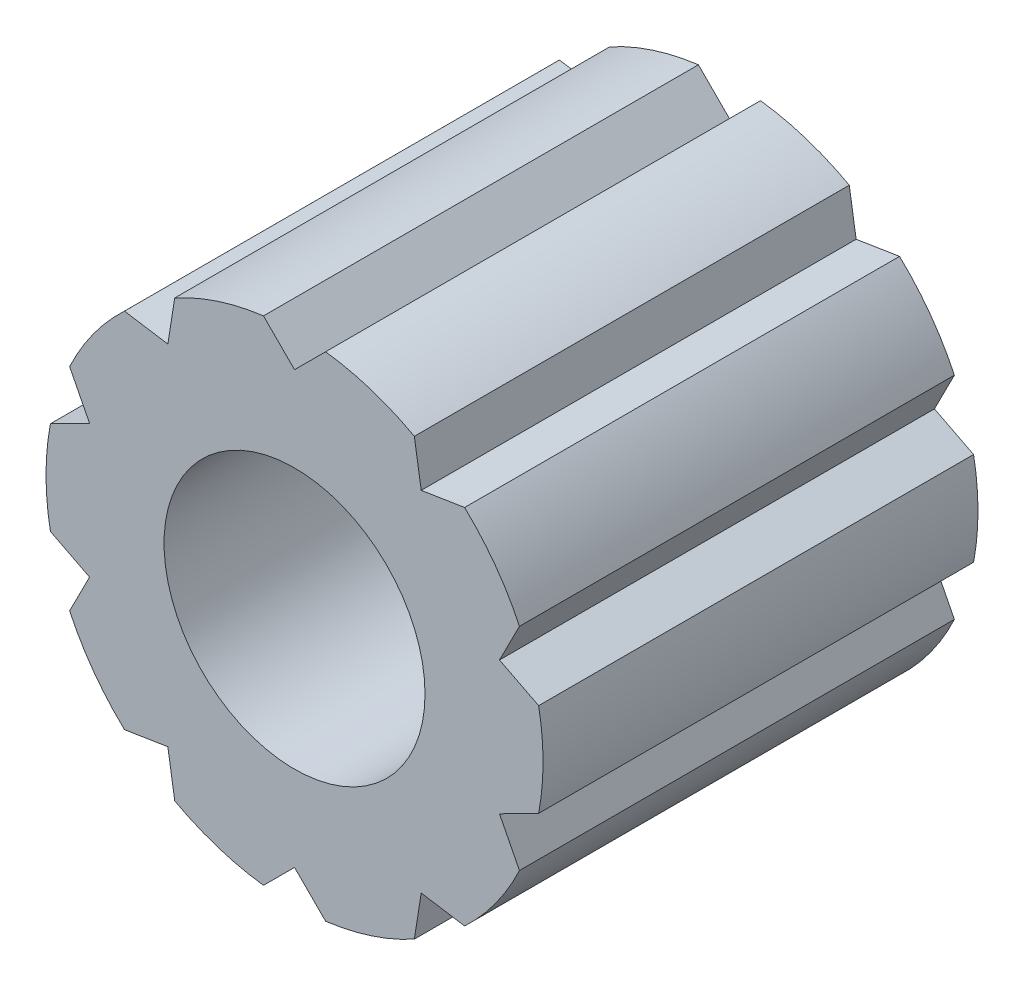
ISO-10303-21;
HEADER;
FILE_DESCRIPTION(('STEP AP214'),'2;1');
FILE_NAME('part.step','',(''),(''),'','','');
FILE_SCHEMA(('AUTOMOTIVE_DESIGN { 1 0 10303 214 1 1 1 1 }'));
ENDSEC;
DATA;
#1=APPLICATION_CONTEXT('core data for automotive mechanical design processes');
#2=APPLICATION_PROTOCOL_DEFINITION('international standard','automotive_design',2000,#1);
#3=PRODUCT_CONTEXT('',#1,'mechanical');
#4=PRODUCT('Part','Part','',(#3));
#5=PRODUCT_RELATED_PRODUCT_CATEGORY('part','',(#4));
#6=PRODUCT_DEFINITION_FORMATION('','',#4);
#7=PRODUCT_DEFINITION_CONTEXT('part definition',#1,'design');
#8=PRODUCT_DEFINITION('design','',#6,#7);
#9=PRODUCT_DEFINITION_SHAPE('','',#8);
#10=(LENGTH_UNIT() NAMED_UNIT(*) SI_UNIT(.MILLI.,.METRE.));
#11=(NAMED_UNIT(*) PLANE_ANGLE_UNIT() SI_UNIT($,.RADIAN.));
#12=(NAMED_UNIT(*) SI_UNIT($,.STERADIAN.) SOLID_ANGLE_UNIT());
#13=UNCERTAINTY_MEASURE_WITH_UNIT(LENGTH_MEASURE(1.E-05),#10,'distance_accuracy_value','');
#14=(GEOMETRIC_REPRESENTATION_CONTEXT(3) GLOBAL_UNCERTAINTY_ASSIGNED_CONTEXT((#13)) GLOBAL_UNIT_ASSIGNED_CONTEXT((#10,
#11,#12)) REPRESENTATION_CONTEXT('',''));
#15=CARTESIAN_POINT('',(0.,0.,0.));
#16=DIRECTION('',(0.,0.,1.));
#17=DIRECTION('',(1.,0.,0.));
#18=AXIS2_PLACEMENT_3D('',#15,#16,#17);
#19=CARTESIAN_POINT('',(0.,0.,7.));
#20=DIRECTION('',(0.,0.,1.));
#21=DIRECTION('',(1.,0.,0.));
#22=AXIS2_PLACEMENT_3D('',#19,#20,#21);
#23=PLANE('',#22);
#24=CARTESIAN_POINT('',(0.,0.,7.));
#25=DIRECTION('',(0.,0.,1.));
#26=DIRECTION('',(1.,0.,0.));
#27=AXIS2_PLACEMENT_3D('',#24,#25,#26);
#28=CIRCLE('',#27,4.);
#29=CARTESIAN_POINT('',(-0.5,3.96862696659689,7.));
#30=VERTEX_POINT('',#29);
#31=CARTESIAN_POINT('',(-1.92819190562839,3.50457928645781,7.));
#32=VERTEX_POINT('',#31);
#33=EDGE_CURVE('E329',#30,#32,#28,.T.);
#34=ORIENTED_EDGE('',*,*,#33,.T.);
#35=DIRECTION('',(-0.156434465040231,-0.987688340595138,0.));
#36=VECTOR('',#35,1.);
#37=CARTESIAN_POINT('',(-1.92819190562839,3.50457928645781,7.));
#38=LINE('',#37,#36);
#39=CARTESIAN_POINT('',(-2.03880777666963,2.8061781631241,7.));
#40=VERTEX_POINT('',#39);
#41=EDGE_CURVE('E167',#32,#40,#38,.T.);
#42=ORIENTED_EDGE('',*,*,#41,.T.);
#43=DIRECTION('',(-0.987688340595138,0.15643446504023,0.));
#44=VECTOR('',#43,1.);
#45=CARTESIAN_POINT('',(-2.03880777666963,2.8061781631241,7.));
#46=LINE('',#45,#44);
#47=CARTESIAN_POINT('',(-2.73720890000334,2.91679403416534,7.));
#48=VERTEX_POINT('',#47);
#49=EDGE_CURVE('E410',#40,#48,#46,.T.);
#50=ORIENTED_EDGE('',*,*,#49,.T.);
#51=CARTESIAN_POINT('',(0.,0.,7.));
#52=DIRECTION('',(0.,0.,1.));
#53=DIRECTION('',(1.,0.,0.));
#54=AXIS2_PLACEMENT_3D('',#51,#52,#53);
#55=CIRCLE('',#54,4.);
#56=CARTESIAN_POINT('',(-3.61988004013916,1.70190143516071,7.));
#57=VERTEX_POINT('',#56);
#58=EDGE_CURVE('E429',#48,#57,#55,.T.);
#59=ORIENTED_EDGE('',*,*,#58,.T.);
#60=DIRECTION('',(0.453990499739546,-0.891006524188368,0.));
#61=VECTOR('',#60,1.);
#62=CARTESIAN_POINT('',(-3.61988004013916,1.70190143516071,7.));
#63=LINE('',#62,#61);
#64=CARTESIAN_POINT('',(-3.29886027917906,1.07186467982566,7.));
#65=VERTEX_POINT('',#64);
#66=EDGE_CURVE('E426',#57,#65,#63,.T.);
#67=ORIENTED_EDGE('',*,*,#66,.T.);
#68=DIRECTION('',(-0.891006524188367,-0.453990499739548,0.));
#69=VECTOR('',#68,1.);
#70=CARTESIAN_POINT('',(-3.29886027917906,1.07186467982566,7.));
#71=LINE('',#70,#69);
#72=CARTESIAN_POINT('',(-3.92889703451411,0.750844918865556,7.));
#73=VERTEX_POINT('',#72);
#74=EDGE_CURVE('E428',#65,#73,#71,.T.);
#75=ORIENTED_EDGE('',*,*,#74,.T.);
#76=CARTESIAN_POINT('',(0.,0.,7.));
#77=DIRECTION('',(0.,0.,1.));
#78=DIRECTION('',(1.,0.,0.));
#79=AXIS2_PLACEMENT_3D('',#76,#77,#78);
#80=CIRCLE('',#79,4.);
#81=CARTESIAN_POINT('',(-3.92889703451411,-0.750844918865558,7.));
#82=VERTEX_POINT('',#81);
#83=EDGE_CURVE('E431',#73,#82,#80,.T.);
#84=ORIENTED_EDGE('',*,*,#83,.T.);
#85=DIRECTION('',(0.891006524188368,-0.453990499739547,0.));
#86=VECTOR('',#85,1.);
#87=CARTESIAN_POINT('',(-3.92889703451411,-0.750844918865558,7.));
#88=LINE('',#87,#86);
#89=CARTESIAN_POINT('',(-3.29886027917906,-1.07186467982566,7.));
#90=VERTEX_POINT('',#89);
#91=EDGE_CURVE('E437',#82,#90,#88,.T.);
#92=ORIENTED_EDGE('',*,*,#91,.T.);
#93=DIRECTION('',(-0.453990499739546,-0.891006524188368,0.));
#94=VECTOR('',#93,1.);
#95=CARTESIAN_POINT('',(-3.29886027917906,-1.07186467982566,7.));
#96=LINE('',#95,#94);
#97=CARTESIAN_POINT('',(-3.61988004013916,-1.70190143516071,7.));
#98=VERTEX_POINT('',#97);
#99=EDGE_CURVE('E439',#90,#98,#96,.T.);
#100=ORIENTED_EDGE('',*,*,#99,.T.);
#101=CARTESIAN_POINT('',(0.,0.,7.));
#102=DIRECTION('',(0.,0.,1.));
#103=DIRECTION('',(1.,0.,0.));
#104=AXIS2_PLACEMENT_3D('',#101,#102,#103);
#105=CIRCLE('',#104,4.);
#106=CARTESIAN_POINT('',(-2.73720890000334,-2.91679403416534,7.));
#107=VERTEX_POINT('',#106);
#108=EDGE_CURVE('E441',#98,#107,#105,.T.);
#109=ORIENTED_EDGE('',*,*,#108,.T.);
#110=DIRECTION('',(0.987688340595138,0.156434465040231,0.));
#111=VECTOR('',#110,1.);
#112=CARTESIAN_POINT('',(-2.73720890000334,-2.91679403416534,7.));
#113=LINE('',#112,#111);
#114=CARTESIAN_POINT('',(-2.03880777666963,-2.8061781631241,7.));
#115=VERTEX_POINT('',#114);
#116=EDGE_CURVE('E443',#107,#115,#113,.T.);
#117=ORIENTED_EDGE('',*,*,#116,.T.);
#118=DIRECTION('',(0.156434465040232,-0.987688340595138,0.));
#119=VECTOR('',#118,1.);
#120=CARTESIAN_POINT('',(-2.03880777666963,-2.8061781631241,7.));
#121=LINE('',#120,#119);
#122=CARTESIAN_POINT('',(-1.92819190562839,-3.50457928645781,7.));
#123=VERTEX_POINT('',#122);
#124=EDGE_CURVE('E445',#115,#123,#121,.T.);
#125=ORIENTED_EDGE('',*,*,#124,.T.);
#126=CARTESIAN_POINT('',(0.,0.,7.));
#127=DIRECTION('',(0.,0.,1.));
#128=DIRECTION('',(1.,0.,0.));
#129=AXIS2_PLACEMENT_3D('',#126,#127,#128);
#130=CIRCLE('',#129,4.);
#131=CARTESIAN_POINT('',(-0.5,-3.96862696659689,7.));
#132=VERTEX_POINT('',#131);
#133=EDGE_CURVE('E447',#123,#132,#130,.T.);
#134=ORIENTED_EDGE('',*,*,#133,.T.);
#135=DIRECTION('',(0.707106781186548,0.707106781186547,0.));
#136=VECTOR('',#135,1.);
#137=CARTESIAN_POINT('',(-0.5,-3.96862696659689,7.));
#138=LINE('',#137,#136);
#139=CARTESIAN_POINT('',(0.,-3.46862696659689,7.));
#140=VERTEX_POINT('',#139);
#141=EDGE_CURVE('E449',#132,#140,#138,.T.);
#142=ORIENTED_EDGE('',*,*,#141,.T.);
#143=DIRECTION('',(0.707106781186548,-0.707106781186547,0.));
#144=VECTOR('',#143,1.);
#145=CARTESIAN_POINT('',(0.,-3.46862696659689,7.));
#146=LINE('',#145,#144);
#147=CARTESIAN_POINT('',(0.499999999999999,-3.96862696659689,7.));
#148=VERTEX_POINT('',#147);
#149=EDGE_CURVE('E451',#140,#148,#146,.T.);
#150=ORIENTED_EDGE('',*,*,#149,.T.);
#151=CARTESIAN_POINT('',(0.,0.,7.));
#152=DIRECTION('',(0.,0.,1.));
#153=DIRECTION('',(1.,0.,0.));
#154=AXIS2_PLACEMENT_3D('',#151,#152,#153);
#155=CIRCLE('',#154,4.);
#156=CARTESIAN_POINT('',(1.92819190562839,-3.50457928645781,7.));
#157=VERTEX_POINT('',#156);
#158=EDGE_CURVE('E453',#148,#157,#155,.T.);
#159=ORIENTED_EDGE('',*,*,#158,.T.);
#160=DIRECTION('',(0.156434465040231,0.987688340595138,0.));
#161=VECTOR('',#160,1.);
#162=CARTESIAN_POINT('',(1.92819190562839,-3.50457928645781,7.));
#163=LINE('',#162,#161);
#164=CARTESIAN_POINT('',(2.03880777666963,-2.8061781631241,7.));
#165=VERTEX_POINT('',#164);
#166=EDGE_CURVE('E455',#157,#165,#163,.T.);
#167=ORIENTED_EDGE('',*,*,#166,.T.);
#168=DIRECTION('',(0.987688340595138,-0.15643446504023,0.));
#169=VECTOR('',#168,1.);
#170=CARTESIAN_POINT('',(2.03880777666963,-2.8061781631241,7.));
#171=LINE('',#170,#169);
#172=CARTESIAN_POINT('',(2.73720890000334,-2.91679403416534,7.));
#173=VERTEX_POINT('',#172);
#174=EDGE_CURVE('E457',#165,#173,#171,.T.);
#175=ORIENTED_EDGE('',*,*,#174,.T.);
#176=CARTESIAN_POINT('',(0.,0.,7.));
#177=DIRECTION('',(0.,0.,1.));
#178=DIRECTION('',(1.,0.,0.));
#179=AXIS2_PLACEMENT_3D('',#176,#177,#178);
#180=CIRCLE('',#179,4.);
#181=CARTESIAN_POINT('',(3.61988004013916,-1.70190143516071,7.));
#182=VERTEX_POINT('',#181);
#183=EDGE_CURVE('E459',#173,#182,#180,.T.);
#184=ORIENTED_EDGE('',*,*,#183,.T.);
#185=DIRECTION('',(-0.453990499739546,0.891006524188368,0.));
#186=VECTOR('',#185,1.);
#187=CARTESIAN_POINT('',(3.61988004013916,-1.70190143516071,7.));
#188=LINE('',#187,#186);
#189=CARTESIAN_POINT('',(3.29886027917906,-1.07186467982566,7.));
#190=VERTEX_POINT('',#189);
#191=EDGE_CURVE('E461',#182,#190,#188,.T.);
#192=ORIENTED_EDGE('',*,*,#191,.T.);
#193=DIRECTION('',(0.891006524188367,0.453990499739548,0.));
#194=VECTOR('',#193,1.);
#195=CARTESIAN_POINT('',(3.29886027917906,-1.07186467982566,7.));
#196=LINE('',#195,#194);
#197=CARTESIAN_POINT('',(3.92889703451411,-0.750844918865558,7.));
#198=VERTEX_POINT('',#197);
#199=EDGE_CURVE('E463',#190,#198,#196,.T.);
#200=ORIENTED_EDGE('',*,*,#199,.T.);
#201=CARTESIAN_POINT('',(0.,0.,7.));
#202=DIRECTION('',(0.,0.,1.));
#203=DIRECTION('',(1.,0.,0.));
#204=AXIS2_PLACEMENT_3D('',#201,#202,#203);
#205=CIRCLE('',#204,4.);
#206=CARTESIAN_POINT('',(3.92889703451411,0.750844918865558,7.));
#207=VERTEX_POINT('',#206);
#208=EDGE_CURVE('E465',#198,#207,#205,.T.);
#209=ORIENTED_EDGE('',*,*,#208,.T.);
#210=DIRECTION('',(-0.891006524188367,0.453990499739548,0.));
#211=VECTOR('',#210,1.);
#212=CARTESIAN_POINT('',(3.92889703451411,0.750844918865558,7.));
#213=LINE('',#212,#211);
#214=CARTESIAN_POINT('',(3.29886027917906,1.07186467982566,7.));
#215=VERTEX_POINT('',#214);
#216=EDGE_CURVE('E467',#207,#215,#213,.T.);
#217=ORIENTED_EDGE('',*,*,#216,.T.);
#218=DIRECTION('',(0.453990499739546,0.891006524188368,0.));
#219=VECTOR('',#218,1.);
#220=CARTESIAN_POINT('',(3.29886027917906,1.07186467982566,7.));
#221=LINE('',#220,#219);
#222=CARTESIAN_POINT('',(3.61988004013916,1.70190143516071,7.));
#223=VERTEX_POINT('',#222);
#224=EDGE_CURVE('E469',#215,#223,#221,.T.);
#225=ORIENTED_EDGE('',*,*,#224,.T.);
#226=CARTESIAN_POINT('',(0.,0.,7.));
#227=DIRECTION('',(0.,0.,1.));
#228=DIRECTION('',(1.,0.,0.));
#229=AXIS2_PLACEMENT_3D('',#226,#227,#228);
#230=CIRCLE('',#229,4.);
#231=CARTESIAN_POINT('',(2.73720890000334,2.91679403416534,7.));
#232=VERTEX_POINT('',#231);
#233=EDGE_CURVE('E471',#223,#232,#230,.T.);
#234=ORIENTED_EDGE('',*,*,#233,.T.);
#235=DIRECTION('',(-0.987688340595138,-0.156434465040231,0.));
#236=VECTOR('',#235,1.);
#237=CARTESIAN_POINT('',(2.73720890000334,2.91679403416534,7.));
#238=LINE('',#237,#236);
#239=CARTESIAN_POINT('',(2.03880777666963,2.8061781631241,7.));
#240=VERTEX_POINT('',#239);
#241=EDGE_CURVE('E473',#232,#240,#238,.T.);
#242=ORIENTED_EDGE('',*,*,#241,.T.);
#243=DIRECTION('',(-0.156434465040231,0.987688340595138,0.));
#244=VECTOR('',#243,1.);
#245=CARTESIAN_POINT('',(2.03880777666963,2.8061781631241,7.));
#246=LINE('',#245,#244);
#247=CARTESIAN_POINT('',(1.92819190562839,3.50457928645781,7.));
#248=VERTEX_POINT('',#247);
#249=EDGE_CURVE('E252',#240,#248,#246,.T.);
#250=ORIENTED_EDGE('',*,*,#249,.T.);
#251=CARTESIAN_POINT('',(0.,0.,7.));
#252=DIRECTION('',(0.,0.,1.));
#253=DIRECTION('',(1.,0.,0.));
#254=AXIS2_PLACEMENT_3D('',#251,#252,#253);
#255=CIRCLE('',#254,4.);
#256=CARTESIAN_POINT('',(0.5,3.96862696659689,7.));
#257=VERTEX_POINT('',#256);
#258=EDGE_CURVE('E246',#248,#257,#255,.T.);
#259=ORIENTED_EDGE('',*,*,#258,.T.);
#260=DIRECTION('',(-0.707106781186548,-0.707106781186547,0.));
#261=VECTOR('',#260,1.);
#262=CARTESIAN_POINT('',(0.5,3.96862696659689,7.));
#263=LINE('',#262,#261);
#264=CARTESIAN_POINT('',(0.,3.46862696659689,7.));
#265=VERTEX_POINT('',#264);
#266=EDGE_CURVE('E250',#257,#265,#263,.T.);
#267=ORIENTED_EDGE('',*,*,#266,.T.);
#268=DIRECTION('',(-0.707106781186548,0.707106781186547,0.));
#269=VECTOR('',#268,1.);
#270=CARTESIAN_POINT('',(0.,3.46862696659689,7.));
#271=LINE('',#270,#269);
#272=EDGE_CURVE('E58',#265,#30,#271,.T.);
#273=ORIENTED_EDGE('',*,*,#272,.T.);
#274=EDGE_LOOP('',(#34,#42,#50,#59,#67,#75,#84,#92,#100,#109,#117,#125,#134,#142,#150,#159,#167,
#175,#184,#192,#200,#209,#217,#225,#234,#242,#250,#259,#267,#273));
#275=FACE_BOUND('',#274,.T.);
#276=CARTESIAN_POINT('',(0.,0.,7.));
#277=DIRECTION('',(0.,0.,1.));
#278=DIRECTION('',(1.,0.,0.));
#279=AXIS2_PLACEMENT_3D('',#276,#277,#278);
#280=CIRCLE('',#279,2.1);
#281=CARTESIAN_POINT('',(2.1,0.,7.));
#282=VERTEX_POINT('',#281);
#283=EDGE_CURVE('E274',#282,#282,#280,.T.);
#284=ORIENTED_EDGE('',*,*,#283,.F.);
#285=EDGE_LOOP('',(#284));
#286=FACE_BOUND('',#285,.T.);
#287=ADVANCED_FACE('F41',(#275,#286),#23,.T.);
#288=CARTESIAN_POINT('',(0.,0.,0.));
#289=DIRECTION('',(0.,0.,1.));
#290=DIRECTION('',(1.,0.,0.));
#291=AXIS2_PLACEMENT_3D('',#288,#289,#290);
#292=PLANE('',#291);
#293=CARTESIAN_POINT('',(0.,0.,0.));
#294=DIRECTION('',(0.,0.,1.));
#295=DIRECTION('',(1.,0.,0.));
#296=AXIS2_PLACEMENT_3D('',#293,#294,#295);
#297=CIRCLE('',#296,4.);
#298=CARTESIAN_POINT('',(-0.5,3.96862696659689,0.));
#299=VERTEX_POINT('',#298);
#300=CARTESIAN_POINT('',(-1.92819190562839,3.50457928645781,0.));
#301=VERTEX_POINT('',#300);
#302=EDGE_CURVE('E270',#299,#301,#297,.T.);
#303=ORIENTED_EDGE('',*,*,#302,.F.);
#304=DIRECTION('',(-0.707106781186548,0.707106781186547,0.));
#305=VECTOR('',#304,1.);
#306=CARTESIAN_POINT('',(0.,3.46862696659689,0.));
#307=LINE('',#306,#305);
#308=CARTESIAN_POINT('',(0.,3.46862696659689,0.));
#309=VERTEX_POINT('',#308);
#310=EDGE_CURVE('E159',#309,#299,#307,.T.);
#311=ORIENTED_EDGE('',*,*,#310,.F.);
#312=DIRECTION('',(-0.707106781186548,-0.707106781186547,0.));
#313=VECTOR('',#312,1.);
#314=CARTESIAN_POINT('',(0.5,3.96862696659689,0.));
#315=LINE('',#314,#313);
#316=CARTESIAN_POINT('',(0.5,3.96862696659689,0.));
#317=VERTEX_POINT('',#316);
#318=EDGE_CURVE('E153',#317,#309,#315,.T.);
#319=ORIENTED_EDGE('',*,*,#318,.F.);
#320=CARTESIAN_POINT('',(0.,0.,0.));
#321=DIRECTION('',(0.,0.,1.));
#322=DIRECTION('',(1.,0.,0.));
#323=AXIS2_PLACEMENT_3D('',#320,#321,#322);
#324=CIRCLE('',#323,4.);
#325=CARTESIAN_POINT('',(1.92819190562839,3.50457928645781,0.));
#326=VERTEX_POINT('',#325);
#327=EDGE_CURVE('E260',#326,#317,#324,.T.);
#328=ORIENTED_EDGE('',*,*,#327,.F.);
#329=DIRECTION('',(-0.156434465040231,0.987688340595138,0.));
#330=VECTOR('',#329,1.);
#331=CARTESIAN_POINT('',(2.03880777666963,2.8061781631241,0.));
#332=LINE('',#331,#330);
#333=CARTESIAN_POINT('',(2.03880777666963,2.8061781631241,0.));
#334=VERTEX_POINT('',#333);
#335=EDGE_CURVE('E324',#334,#326,#332,.T.);
#336=ORIENTED_EDGE('',*,*,#335,.F.);
#337=DIRECTION('',(-0.987688340595138,-0.156434465040231,0.));
#338=VECTOR('',#337,1.);
#339=CARTESIAN_POINT('',(2.73720890000334,2.91679403416534,0.));
#340=LINE('',#339,#338);
#341=CARTESIAN_POINT('',(2.73720890000334,2.91679403416534,0.));
#342=VERTEX_POINT('',#341);
#343=EDGE_CURVE('E322',#342,#334,#340,.T.);
#344=ORIENTED_EDGE('',*,*,#343,.F.);
#345=CARTESIAN_POINT('',(0.,0.,0.));
#346=DIRECTION('',(0.,0.,1.));
#347=DIRECTION('',(1.,0.,0.));
#348=AXIS2_PLACEMENT_3D('',#345,#346,#347);
#349=CIRCLE('',#348,4.);
#350=CARTESIAN_POINT('',(3.61988004013916,1.70190143516071,0.));
#351=VERTEX_POINT('',#350);
#352=EDGE_CURVE('E320',#351,#342,#349,.T.);
#353=ORIENTED_EDGE('',*,*,#352,.F.);
#354=DIRECTION('',(0.453990499739546,0.891006524188368,0.));
#355=VECTOR('',#354,1.);
#356=CARTESIAN_POINT('',(3.29886027917906,1.07186467982566,0.));
#357=LINE('',#356,#355);
#358=CARTESIAN_POINT('',(3.29886027917906,1.07186467982566,0.));
#359=VERTEX_POINT('',#358);
#360=EDGE_CURVE('E318',#359,#351,#357,.T.);
#361=ORIENTED_EDGE('',*,*,#360,.F.);
#362=DIRECTION('',(-0.891006524188367,0.453990499739548,0.));
#363=VECTOR('',#362,1.);
#364=CARTESIAN_POINT('',(3.92889703451411,0.750844918865558,0.));
#365=LINE('',#364,#363);
#366=CARTESIAN_POINT('',(3.92889703451411,0.750844918865558,0.));
#367=VERTEX_POINT('',#366);
#368=EDGE_CURVE('E316',#367,#359,#365,.T.);
#369=ORIENTED_EDGE('',*,*,#368,.F.);
#370=CARTESIAN_POINT('',(0.,0.,0.));
#371=DIRECTION('',(0.,0.,1.));
#372=DIRECTION('',(1.,0.,0.));
#373=AXIS2_PLACEMENT_3D('',#370,#371,#372);
#374=CIRCLE('',#373,4.);
#375=CARTESIAN_POINT('',(3.92889703451411,-0.750844918865558,0.));
#376=VERTEX_POINT('',#375);
#377=EDGE_CURVE('E314',#376,#367,#374,.T.);
#378=ORIENTED_EDGE('',*,*,#377,.F.);
#379=DIRECTION('',(0.891006524188367,0.453990499739548,0.));
#380=VECTOR('',#379,1.);
#381=CARTESIAN_POINT('',(3.29886027917906,-1.07186467982566,0.));
#382=LINE('',#381,#380);
#383=CARTESIAN_POINT('',(3.29886027917906,-1.07186467982566,0.));
#384=VERTEX_POINT('',#383);
#385=EDGE_CURVE('E312',#384,#376,#382,.T.);
#386=ORIENTED_EDGE('',*,*,#385,.F.);
#387=DIRECTION('',(-0.453990499739546,0.891006524188368,0.));
#388=VECTOR('',#387,1.);
#389=CARTESIAN_POINT('',(3.61988004013916,-1.70190143516071,0.));
#390=LINE('',#389,#388);
#391=CARTESIAN_POINT('',(3.61988004013916,-1.70190143516071,0.));
#392=VERTEX_POINT('',#391);
#393=EDGE_CURVE('E310',#392,#384,#390,.T.);
#394=ORIENTED_EDGE('',*,*,#393,.F.);
#395=CARTESIAN_POINT('',(0.,0.,0.));
#396=DIRECTION('',(0.,0.,1.));
#397=DIRECTION('',(1.,0.,0.));
#398=AXIS2_PLACEMENT_3D('',#395,#396,#397);
#399=CIRCLE('',#398,4.);
#400=CARTESIAN_POINT('',(2.73720890000334,-2.91679403416534,0.));
#401=VERTEX_POINT('',#400);
#402=EDGE_CURVE('E308',#401,#392,#399,.T.);
#403=ORIENTED_EDGE('',*,*,#402,.F.);
#404=DIRECTION('',(0.987688340595138,-0.15643446504023,0.));
#405=VECTOR('',#404,1.);
#406=CARTESIAN_POINT('',(2.03880777666963,-2.8061781631241,0.));
#407=LINE('',#406,#405);
#408=CARTESIAN_POINT('',(2.03880777666963,-2.8061781631241,0.));
#409=VERTEX_POINT('',#408);
#410=EDGE_CURVE('E306',#409,#401,#407,.T.);
#411=ORIENTED_EDGE('',*,*,#410,.F.);
#412=DIRECTION('',(0.156434465040231,0.987688340595138,0.));
#413=VECTOR('',#412,1.);
#414=CARTESIAN_POINT('',(1.92819190562839,-3.50457928645781,0.));
#415=LINE('',#414,#413);
#416=CARTESIAN_POINT('',(1.92819190562839,-3.50457928645781,0.));
#417=VERTEX_POINT('',#416);
#418=EDGE_CURVE('E304',#417,#409,#415,.T.);
#419=ORIENTED_EDGE('',*,*,#418,.F.);
#420=CARTESIAN_POINT('',(0.,0.,0.));
#421=DIRECTION('',(0.,0.,1.));
#422=DIRECTION('',(1.,0.,0.));
#423=AXIS2_PLACEMENT_3D('',#420,#421,#422);
#424=CIRCLE('',#423,4.);
#425=CARTESIAN_POINT('',(0.499999999999999,-3.96862696659689,0.));
#426=VERTEX_POINT('',#425);
#427=EDGE_CURVE('E302',#426,#417,#424,.T.);
#428=ORIENTED_EDGE('',*,*,#427,.F.);
#429=DIRECTION('',(0.707106781186548,-0.707106781186547,0.));
#430=VECTOR('',#429,1.);
#431=CARTESIAN_POINT('',(0.,-3.46862696659689,0.));
#432=LINE('',#431,#430);
#433=CARTESIAN_POINT('',(0.,-3.46862696659689,0.));
#434=VERTEX_POINT('',#433);
#435=EDGE_CURVE('E300',#434,#426,#432,.T.);
#436=ORIENTED_EDGE('',*,*,#435,.F.);
#437=DIRECTION('',(0.707106781186548,0.707106781186547,0.));
#438=VECTOR('',#437,1.);
#439=CARTESIAN_POINT('',(-0.5,-3.96862696659689,0.));
#440=LINE('',#439,#438);
#441=CARTESIAN_POINT('',(-0.5,-3.96862696659689,0.));
#442=VERTEX_POINT('',#441);
#443=EDGE_CURVE('E298',#442,#434,#440,.T.);
#444=ORIENTED_EDGE('',*,*,#443,.F.);
#445=CARTESIAN_POINT('',(0.,0.,0.));
#446=DIRECTION('',(0.,0.,1.));
#447=DIRECTION('',(1.,0.,0.));
#448=AXIS2_PLACEMENT_3D('',#445,#446,#447);
#449=CIRCLE('',#448,4.);
#450=CARTESIAN_POINT('',(-1.92819190562839,-3.50457928645781,0.));
#451=VERTEX_POINT('',#450);
#452=EDGE_CURVE('E296',#451,#442,#449,.T.);
#453=ORIENTED_EDGE('',*,*,#452,.F.);
#454=DIRECTION('',(0.156434465040232,-0.987688340595138,0.));
#455=VECTOR('',#454,1.);
#456=CARTESIAN_POINT('',(-2.03880777666963,-2.8061781631241,0.));
#457=LINE('',#456,#455);
#458=CARTESIAN_POINT('',(-2.03880777666963,-2.8061781631241,0.));
#459=VERTEX_POINT('',#458);
#460=EDGE_CURVE('E294',#459,#451,#457,.T.);
#461=ORIENTED_EDGE('',*,*,#460,.F.);
#462=DIRECTION('',(0.987688340595138,0.156434465040231,0.));
#463=VECTOR('',#462,1.);
#464=CARTESIAN_POINT('',(-2.73720890000334,-2.91679403416534,0.));
#465=LINE('',#464,#463);
#466=CARTESIAN_POINT('',(-2.73720890000334,-2.91679403416534,0.));
#467=VERTEX_POINT('',#466);
#468=EDGE_CURVE('E292',#467,#459,#465,.T.);
#469=ORIENTED_EDGE('',*,*,#468,.F.);
#470=CARTESIAN_POINT('',(0.,0.,0.));
#471=DIRECTION('',(0.,0.,1.));
#472=DIRECTION('',(1.,0.,0.));
#473=AXIS2_PLACEMENT_3D('',#470,#471,#472);
#474=CIRCLE('',#473,4.);
#475=CARTESIAN_POINT('',(-3.61988004013916,-1.70190143516071,0.));
#476=VERTEX_POINT('',#475);
#477=EDGE_CURVE('E290',#476,#467,#474,.T.);
#478=ORIENTED_EDGE('',*,*,#477,.F.);
#479=DIRECTION('',(-0.453990499739546,-0.891006524188368,0.));
#480=VECTOR('',#479,1.);
#481=CARTESIAN_POINT('',(-3.29886027917906,-1.07186467982566,0.));
#482=LINE('',#481,#480);
#483=CARTESIAN_POINT('',(-3.29886027917906,-1.07186467982566,0.));
#484=VERTEX_POINT('',#483);
#485=EDGE_CURVE('E288',#484,#476,#482,.T.);
#486=ORIENTED_EDGE('',*,*,#485,.F.);
#487=DIRECTION('',(0.891006524188368,-0.453990499739547,0.));
#488=VECTOR('',#487,1.);
#489=CARTESIAN_POINT('',(-3.92889703451411,-0.750844918865558,0.));
#490=LINE('',#489,#488);
#491=CARTESIAN_POINT('',(-3.92889703451411,-0.750844918865558,0.));
#492=VERTEX_POINT('',#491);
#493=EDGE_CURVE('E286',#492,#484,#490,.T.);
#494=ORIENTED_EDGE('',*,*,#493,.F.);
#495=CARTESIAN_POINT('',(0.,0.,0.));
#496=DIRECTION('',(0.,0.,1.));
#497=DIRECTION('',(1.,0.,0.));
#498=AXIS2_PLACEMENT_3D('',#495,#496,#497);
#499=CIRCLE('',#498,4.);
#500=CARTESIAN_POINT('',(-3.92889703451411,0.750844918865556,0.));
#501=VERTEX_POINT('',#500);
#502=EDGE_CURVE('E284',#501,#492,#499,.T.);
#503=ORIENTED_EDGE('',*,*,#502,.F.);
#504=DIRECTION('',(-0.891006524188367,-0.453990499739548,0.));
#505=VECTOR('',#504,1.);
#506=CARTESIAN_POINT('',(-3.29886027917906,1.07186467982566,0.));
#507=LINE('',#506,#505);
#508=CARTESIAN_POINT('',(-3.29886027917906,1.07186467982566,0.));
#509=VERTEX_POINT('',#508);
#510=EDGE_CURVE('E282',#509,#501,#507,.T.);
#511=ORIENTED_EDGE('',*,*,#510,.F.);
#512=DIRECTION('',(0.453990499739546,-0.891006524188368,0.));
#513=VECTOR('',#512,1.);
#514=CARTESIAN_POINT('',(-3.61988004013916,1.70190143516071,0.));
#515=LINE('',#514,#513);
#516=CARTESIAN_POINT('',(-3.61988004013916,1.70190143516071,0.));
#517=VERTEX_POINT('',#516);
#518=EDGE_CURVE('E280',#517,#509,#515,.T.);
#519=ORIENTED_EDGE('',*,*,#518,.F.);
#520=CARTESIAN_POINT('',(0.,0.,0.));
#521=DIRECTION('',(0.,0.,1.));
#522=DIRECTION('',(1.,0.,0.));
#523=AXIS2_PLACEMENT_3D('',#520,#521,#522);
#524=CIRCLE('',#523,4.);
#525=CARTESIAN_POINT('',(-2.73720890000334,2.91679403416534,0.));
#526=VERTEX_POINT('',#525);
#527=EDGE_CURVE('E278',#526,#517,#524,.T.);
#528=ORIENTED_EDGE('',*,*,#527,.F.);
#529=DIRECTION('',(-0.987688340595138,0.15643446504023,0.));
#530=VECTOR('',#529,1.);
#531=CARTESIAN_POINT('',(-2.03880777666963,2.8061781631241,0.));
#532=LINE('',#531,#530);
#533=CARTESIAN_POINT('',(-2.03880777666963,2.8061781631241,0.));
#534=VERTEX_POINT('',#533);
#535=EDGE_CURVE('E276',#534,#526,#532,.T.);
#536=ORIENTED_EDGE('',*,*,#535,.F.);
#537=DIRECTION('',(-0.156434465040231,-0.987688340595138,0.));
#538=VECTOR('',#537,1.);
#539=CARTESIAN_POINT('',(-1.92819190562839,3.50457928645781,0.));
#540=LINE('',#539,#538);
#541=EDGE_CURVE('E273',#301,#534,#540,.T.);
#542=ORIENTED_EDGE('',*,*,#541,.F.);
#543=EDGE_LOOP('',(#303,#311,#319,#328,#336,#344,#353,#361,#369,#378,#386,#394,#403,#411,#419,
#428,#436,#444,#453,#461,#469,#478,#486,#494,#503,#511,#519,#528,#536,#542));
#544=FACE_BOUND('',#543,.T.);
#545=CARTESIAN_POINT('',(0.,0.,0.));
#546=DIRECTION('',(0.,0.,1.));
#547=DIRECTION('',(1.,0.,0.));
#548=AXIS2_PLACEMENT_3D('',#545,#546,#547);
#549=CIRCLE('',#548,2.1);
#550=CARTESIAN_POINT('',(2.1,0.,0.));
#551=VERTEX_POINT('',#550);
#552=EDGE_CURVE('E854',#551,#551,#549,.T.);
#553=ORIENTED_EDGE('',*,*,#552,.T.);
#554=EDGE_LOOP('',(#553));
#555=FACE_BOUND('',#554,.T.);
#556=ADVANCED_FACE('F414',(#544,#555),#292,.F.);
#557=CARTESIAN_POINT('',(0.,0.,7.));
#558=DIRECTION('',(0.,0.,-1.));
#559=DIRECTION('',(-1.,0.,0.));
#560=AXIS2_PLACEMENT_3D('',#557,#558,#559);
#561=CYLINDRICAL_SURFACE('',#560,4.);
#562=ORIENTED_EDGE('',*,*,#302,.T.);
#563=DIRECTION('',(0.,0.,-1.));
#564=VECTOR('',#563,1.);
#565=CARTESIAN_POINT('',(-1.92819190562839,3.50457928645781,7.));
#566=LINE('',#565,#564);
#567=EDGE_CURVE('E11',#32,#301,#566,.T.);
#568=ORIENTED_EDGE('',*,*,#567,.F.);
#569=ORIENTED_EDGE('',*,*,#33,.F.);
#570=DIRECTION('',(0.,0.,-1.));
#571=VECTOR('',#570,1.);
#572=CARTESIAN_POINT('',(-0.5,3.96862696659689,7.));
#573=LINE('',#572,#571);
#574=EDGE_CURVE('E266',#30,#299,#573,.T.);
#575=ORIENTED_EDGE('',*,*,#574,.T.);
#576=EDGE_LOOP('',(#562,#568,#569,#575));
#577=FACE_BOUND('',#576,.T.);
#578=ADVANCED_FACE('F43',(#577),#561,.T.);
#579=CARTESIAN_POINT('',(-1.92819190562839,3.50457928645781,7.));
#580=DIRECTION('',(0.987688340595138,-0.156434465040231,0.));
#581=DIRECTION('',(0.156434465040231,0.987688340595138,0.));
#582=AXIS2_PLACEMENT_3D('',#579,#580,#581);
#583=PLANE('',#582);
#584=ORIENTED_EDGE('',*,*,#541,.T.);
#585=DIRECTION('',(0.,0.,-1.));
#586=VECTOR('',#585,1.);
#587=CARTESIAN_POINT('',(-2.03880777666963,2.8061781631241,7.));
#588=LINE('',#587,#586);
#589=EDGE_CURVE('E50',#40,#534,#588,.T.);
#590=ORIENTED_EDGE('',*,*,#589,.F.);
#591=ORIENTED_EDGE('',*,*,#41,.F.);
#592=ORIENTED_EDGE('',*,*,#567,.T.);
#593=EDGE_LOOP('',(#584,#590,#591,#592));
#594=FACE_BOUND('',#593,.T.);
#595=ADVANCED_FACE('F507',(#594),#583,.F.);
#596=CARTESIAN_POINT('',(-2.03880777666963,2.8061781631241,7.));
#597=DIRECTION('',(-0.15643446504023,-0.987688340595138,0.));
#598=DIRECTION('',(0.987688340595138,-0.15643446504023,0.));
#599=AXIS2_PLACEMENT_3D('',#596,#597,#598);
#600=PLANE('',#599);
#601=ORIENTED_EDGE('',*,*,#535,.T.);
#602=DIRECTION('',(0.,0.,-1.));
#603=VECTOR('',#602,1.);
#604=CARTESIAN_POINT('',(-2.73720890000334,2.91679403416534,7.));
#605=LINE('',#604,#603);
#606=EDGE_CURVE('E402',#48,#526,#605,.T.);
#607=ORIENTED_EDGE('',*,*,#606,.F.);
#608=ORIENTED_EDGE('',*,*,#49,.F.);
#609=ORIENTED_EDGE('',*,*,#589,.T.);
#610=EDGE_LOOP('',(#601,#607,#608,#609));
#611=FACE_BOUND('',#610,.T.);
#612=ADVANCED_FACE('F408',(#611),#600,.F.);
#613=CARTESIAN_POINT('',(0.,0.,7.));
#614=DIRECTION('',(0.,0.,-1.));
#615=DIRECTION('',(-1.,0.,0.));
#616=AXIS2_PLACEMENT_3D('',#613,#614,#615);
#617=CYLINDRICAL_SURFACE('',#616,4.);
#618=ORIENTED_EDGE('',*,*,#527,.T.);
#619=DIRECTION('',(0.,0.,-1.));
#620=VECTOR('',#619,1.);
#621=CARTESIAN_POINT('',(-3.61988004013916,1.70190143516071,7.));
#622=LINE('',#621,#620);
#623=EDGE_CURVE('E399',#57,#517,#622,.T.);
#624=ORIENTED_EDGE('',*,*,#623,.F.);
#625=ORIENTED_EDGE('',*,*,#58,.F.);
#626=ORIENTED_EDGE('',*,*,#606,.T.);
#627=EDGE_LOOP('',(#618,#624,#625,#626));
#628=FACE_BOUND('',#627,.T.);
#629=ADVANCED_FACE('F420',(#628),#617,.T.);
#630=CARTESIAN_POINT('',(-3.61988004013916,1.70190143516071,7.));
#631=DIRECTION('',(0.891006524188368,0.453990499739546,0.));
#632=DIRECTION('',(-0.453990499739546,0.891006524188368,0.));
#633=AXIS2_PLACEMENT_3D('',#630,#631,#632);
#634=PLANE('',#633);
#635=ORIENTED_EDGE('',*,*,#518,.T.);
#636=DIRECTION('',(0.,0.,-1.));
#637=VECTOR('',#636,1.);
#638=CARTESIAN_POINT('',(-3.29886027917906,1.07186467982566,7.));
#639=LINE('',#638,#637);
#640=EDGE_CURVE('E396',#65,#509,#639,.T.);
#641=ORIENTED_EDGE('',*,*,#640,.F.);
#642=ORIENTED_EDGE('',*,*,#66,.F.);
#643=ORIENTED_EDGE('',*,*,#623,.T.);
#644=EDGE_LOOP('',(#635,#641,#642,#643));
#645=FACE_BOUND('',#644,.T.);
#646=ADVANCED_FACE('F424',(#645),#634,.F.);
#647=CARTESIAN_POINT('',(-3.29886027917906,1.07186467982566,7.));
#648=DIRECTION('',(0.453990499739548,-0.891006524188367,0.));
#649=DIRECTION('',(0.891006524188367,0.453990499739548,0.));
#650=AXIS2_PLACEMENT_3D('',#647,#648,#649);
#651=PLANE('',#650);
#652=ORIENTED_EDGE('',*,*,#510,.T.);
#653=DIRECTION('',(0.,0.,-1.));
#654=VECTOR('',#653,1.);
#655=CARTESIAN_POINT('',(-3.92889703451411,0.750844918865556,7.));
#656=LINE('',#655,#654);
#657=EDGE_CURVE('E393',#73,#501,#656,.T.);
#658=ORIENTED_EDGE('',*,*,#657,.F.);
#659=ORIENTED_EDGE('',*,*,#74,.F.);
#660=ORIENTED_EDGE('',*,*,#640,.T.);
#661=EDGE_LOOP('',(#652,#658,#659,#660));
#662=FACE_BOUND('',#661,.T.);
#663=ADVANCED_FACE('F520',(#662),#651,.F.);
#664=CARTESIAN_POINT('',(0.,0.,7.));
#665=DIRECTION('',(0.,0.,-1.));
#666=DIRECTION('',(-1.,0.,0.));
#667=AXIS2_PLACEMENT_3D('',#664,#665,#666);
#668=CYLINDRICAL_SURFACE('',#667,4.);
#669=ORIENTED_EDGE('',*,*,#502,.T.);
#670=DIRECTION('',(0.,0.,-1.));
#671=VECTOR('',#670,1.);
#672=CARTESIAN_POINT('',(-3.92889703451411,-0.750844918865558,7.));
#673=LINE('',#672,#671);
#674=EDGE_CURVE('E390',#82,#492,#673,.T.);
#675=ORIENTED_EDGE('',*,*,#674,.F.);
#676=ORIENTED_EDGE('',*,*,#83,.F.);
#677=ORIENTED_EDGE('',*,*,#657,.T.);
#678=EDGE_LOOP('',(#669,#675,#676,#677));
#679=FACE_BOUND('',#678,.T.);
#680=ADVANCED_FACE('F523',(#679),#668,.T.);
#681=CARTESIAN_POINT('',(-3.92889703451411,-0.750844918865558,7.));
#682=DIRECTION('',(0.453990499739547,0.891006524188368,0.));
#683=DIRECTION('',(-0.891006524188368,0.453990499739547,0.));
#684=AXIS2_PLACEMENT_3D('',#681,#682,#683);
#685=PLANE('',#684);
#686=ORIENTED_EDGE('',*,*,#493,.T.);
#687=DIRECTION('',(0.,0.,-1.));
#688=VECTOR('',#687,1.);
#689=CARTESIAN_POINT('',(-3.29886027917906,-1.07186467982566,7.));
#690=LINE('',#689,#688);
#691=EDGE_CURVE('E387',#90,#484,#690,.T.);
#692=ORIENTED_EDGE('',*,*,#691,.F.);
#693=ORIENTED_EDGE('',*,*,#91,.F.);
#694=ORIENTED_EDGE('',*,*,#674,.T.);
#695=EDGE_LOOP('',(#686,#692,#693,#694));
#696=FACE_BOUND('',#695,.T.);
#697=ADVANCED_FACE('F527',(#696),#685,.F.);
#698=CARTESIAN_POINT('',(-3.29886027917906,-1.07186467982566,7.));
#699=DIRECTION('',(0.891006524188368,-0.453990499739546,0.));
#700=DIRECTION('',(0.453990499739546,0.891006524188368,0.));
#701=AXIS2_PLACEMENT_3D('',#698,#699,#700);
#702=PLANE('',#701);
#703=ORIENTED_EDGE('',*,*,#485,.T.);
#704=DIRECTION('',(0.,0.,-1.));
#705=VECTOR('',#704,1.);
#706=CARTESIAN_POINT('',(-3.61988004013916,-1.70190143516071,7.));
#707=LINE('',#706,#705);
#708=EDGE_CURVE('E384',#98,#476,#707,.T.);
#709=ORIENTED_EDGE('',*,*,#708,.F.);
#710=ORIENTED_EDGE('',*,*,#99,.F.);
#711=ORIENTED_EDGE('',*,*,#691,.T.);
#712=EDGE_LOOP('',(#703,#709,#710,#711));
#713=FACE_BOUND('',#712,.T.);
#714=ADVANCED_FACE('F531',(#713),#702,.F.);
#715=CARTESIAN_POINT('',(0.,0.,7.));
#716=DIRECTION('',(0.,0.,-1.));
#717=DIRECTION('',(-1.,0.,0.));
#718=AXIS2_PLACEMENT_3D('',#715,#716,#717);
#719=CYLINDRICAL_SURFACE('',#718,4.);
#720=ORIENTED_EDGE('',*,*,#477,.T.);
#721=DIRECTION('',(0.,0.,-1.));
#722=VECTOR('',#721,1.);
#723=CARTESIAN_POINT('',(-2.73720890000334,-2.91679403416534,7.));
#724=LINE('',#723,#722);
#725=EDGE_CURVE('E381',#107,#467,#724,.T.);
#726=ORIENTED_EDGE('',*,*,#725,.F.);
#727=ORIENTED_EDGE('',*,*,#108,.F.);
#728=ORIENTED_EDGE('',*,*,#708,.T.);
#729=EDGE_LOOP('',(#720,#726,#727,#728));
#730=FACE_BOUND('',#729,.T.);
#731=ADVANCED_FACE('F535',(#730),#719,.T.);
#732=CARTESIAN_POINT('',(-2.73720890000334,-2.91679403416534,7.));
#733=DIRECTION('',(-0.156434465040231,0.987688340595138,0.));
#734=DIRECTION('',(-0.987688340595138,-0.156434465040231,0.));
#735=AXIS2_PLACEMENT_3D('',#732,#733,#734);
#736=PLANE('',#735);
#737=ORIENTED_EDGE('',*,*,#468,.T.);
#738=DIRECTION('',(0.,0.,-1.));
#739=VECTOR('',#738,1.);
#740=CARTESIAN_POINT('',(-2.03880777666963,-2.8061781631241,7.));
#741=LINE('',#740,#739);
#742=EDGE_CURVE('E378',#115,#459,#741,.T.);
#743=ORIENTED_EDGE('',*,*,#742,.F.);
#744=ORIENTED_EDGE('',*,*,#116,.F.);
#745=ORIENTED_EDGE('',*,*,#725,.T.);
#746=EDGE_LOOP('',(#737,#743,#744,#745));
#747=FACE_BOUND('',#746,.T.);
#748=ADVANCED_FACE('F539',(#747),#736,.F.);
#749=CARTESIAN_POINT('',(-2.03880777666963,-2.8061781631241,7.));
#750=DIRECTION('',(0.987688340595138,0.156434465040232,0.));
#751=DIRECTION('',(-0.156434465040232,0.987688340595138,0.));
#752=AXIS2_PLACEMENT_3D('',#749,#750,#751);
#753=PLANE('',#752);
#754=ORIENTED_EDGE('',*,*,#460,.T.);
#755=DIRECTION('',(0.,0.,-1.));
#756=VECTOR('',#755,1.);
#757=CARTESIAN_POINT('',(-1.92819190562839,-3.50457928645781,7.));
#758=LINE('',#757,#756);
#759=EDGE_CURVE('E375',#123,#451,#758,.T.);
#760=ORIENTED_EDGE('',*,*,#759,.F.);
#761=ORIENTED_EDGE('',*,*,#124,.F.);
#762=ORIENTED_EDGE('',*,*,#742,.T.);
#763=EDGE_LOOP('',(#754,#760,#761,#762));
#764=FACE_BOUND('',#763,.T.);
#765=ADVANCED_FACE('F543',(#764),#753,.F.);
#766=CARTESIAN_POINT('',(0.,0.,7.));
#767=DIRECTION('',(0.,0.,-1.));
#768=DIRECTION('',(-1.,0.,0.));
#769=AXIS2_PLACEMENT_3D('',#766,#767,#768);
#770=CYLINDRICAL_SURFACE('',#769,4.);
#771=ORIENTED_EDGE('',*,*,#452,.T.);
#772=DIRECTION('',(0.,0.,-1.));
#773=VECTOR('',#772,1.);
#774=CARTESIAN_POINT('',(-0.5,-3.96862696659689,7.));
#775=LINE('',#774,#773);
#776=EDGE_CURVE('E372',#132,#442,#775,.T.);
#777=ORIENTED_EDGE('',*,*,#776,.F.);
#778=ORIENTED_EDGE('',*,*,#133,.F.);
#779=ORIENTED_EDGE('',*,*,#759,.T.);
#780=EDGE_LOOP('',(#771,#777,#778,#779));
#781=FACE_BOUND('',#780,.T.);
#782=ADVANCED_FACE('F547',(#781),#770,.T.);
#783=CARTESIAN_POINT('',(-0.5,-3.96862696659689,7.));
#784=DIRECTION('',(-0.707106781186547,0.707106781186548,0.));
#785=DIRECTION('',(-0.707106781186548,-0.707106781186547,0.));
#786=AXIS2_PLACEMENT_3D('',#783,#784,#785);
#787=PLANE('',#786);
#788=ORIENTED_EDGE('',*,*,#443,.T.);
#789=DIRECTION('',(0.,0.,-1.));
#790=VECTOR('',#789,1.);
#791=CARTESIAN_POINT('',(0.,-3.46862696659689,7.));
#792=LINE('',#791,#790);
#793=EDGE_CURVE('E369',#140,#434,#792,.T.);
#794=ORIENTED_EDGE('',*,*,#793,.F.);
#795=ORIENTED_EDGE('',*,*,#141,.F.);
#796=ORIENTED_EDGE('',*,*,#776,.T.);
#797=EDGE_LOOP('',(#788,#794,#795,#796));
#798=FACE_BOUND('',#797,.T.);
#799=ADVANCED_FACE('F551',(#798),#787,.F.);
#800=CARTESIAN_POINT('',(0.,-3.46862696659689,7.));
#801=DIRECTION('',(0.707106781186547,0.707106781186548,0.));
#802=DIRECTION('',(-0.707106781186548,0.707106781186547,0.));
#803=AXIS2_PLACEMENT_3D('',#800,#801,#802);
#804=PLANE('',#803);
#805=ORIENTED_EDGE('',*,*,#435,.T.);
#806=DIRECTION('',(0.,0.,-1.));
#807=VECTOR('',#806,1.);
#808=CARTESIAN_POINT('',(0.499999999999999,-3.96862696659689,7.));
#809=LINE('',#808,#807);
#810=EDGE_CURVE('E366',#148,#426,#809,.T.);
#811=ORIENTED_EDGE('',*,*,#810,.F.);
#812=ORIENTED_EDGE('',*,*,#149,.F.);
#813=ORIENTED_EDGE('',*,*,#793,.T.);
#814=EDGE_LOOP('',(#805,#811,#812,#813));
#815=FACE_BOUND('',#814,.T.);
#816=ADVANCED_FACE('F555',(#815),#804,.F.);
#817=CARTESIAN_POINT('',(0.,0.,7.));
#818=DIRECTION('',(0.,0.,-1.));
#819=DIRECTION('',(-1.,0.,0.));
#820=AXIS2_PLACEMENT_3D('',#817,#818,#819);
#821=CYLINDRICAL_SURFACE('',#820,4.);
#822=ORIENTED_EDGE('',*,*,#427,.T.);
#823=DIRECTION('',(0.,0.,-1.));
#824=VECTOR('',#823,1.);
#825=CARTESIAN_POINT('',(1.92819190562839,-3.50457928645781,7.));
#826=LINE('',#825,#824);
#827=EDGE_CURVE('E363',#157,#417,#826,.T.);
#828=ORIENTED_EDGE('',*,*,#827,.F.);
#829=ORIENTED_EDGE('',*,*,#158,.F.);
#830=ORIENTED_EDGE('',*,*,#810,.T.);
#831=EDGE_LOOP('',(#822,#828,#829,#830));
#832=FACE_BOUND('',#831,.T.);
#833=ADVANCED_FACE('F559',(#832),#821,.T.);
#834=CARTESIAN_POINT('',(1.92819190562839,-3.50457928645781,7.));
#835=DIRECTION('',(-0.987688340595138,0.156434465040231,0.));
#836=DIRECTION('',(-0.156434465040231,-0.987688340595138,0.));
#837=AXIS2_PLACEMENT_3D('',#834,#835,#836);
#838=PLANE('',#837);
#839=ORIENTED_EDGE('',*,*,#418,.T.);
#840=DIRECTION('',(0.,0.,-1.));
#841=VECTOR('',#840,1.);
#842=CARTESIAN_POINT('',(2.03880777666963,-2.8061781631241,7.));
#843=LINE('',#842,#841);
#844=EDGE_CURVE('E360',#165,#409,#843,.T.);
#845=ORIENTED_EDGE('',*,*,#844,.F.);
#846=ORIENTED_EDGE('',*,*,#166,.F.);
#847=ORIENTED_EDGE('',*,*,#827,.T.);
#848=EDGE_LOOP('',(#839,#845,#846,#847));
#849=FACE_BOUND('',#848,.T.);
#850=ADVANCED_FACE('F563',(#849),#838,.F.);
#851=CARTESIAN_POINT('',(2.03880777666963,-2.8061781631241,7.));
#852=DIRECTION('',(0.15643446504023,0.987688340595138,0.));
#853=DIRECTION('',(-0.987688340595138,0.15643446504023,0.));
#854=AXIS2_PLACEMENT_3D('',#851,#852,#853);
#855=PLANE('',#854);
#856=ORIENTED_EDGE('',*,*,#410,.T.);
#857=DIRECTION('',(0.,0.,-1.));
#858=VECTOR('',#857,1.);
#859=CARTESIAN_POINT('',(2.73720890000334,-2.91679403416534,7.));
#860=LINE('',#859,#858);
#861=EDGE_CURVE('E357',#173,#401,#860,.T.);
#862=ORIENTED_EDGE('',*,*,#861,.F.);
#863=ORIENTED_EDGE('',*,*,#174,.F.);
#864=ORIENTED_EDGE('',*,*,#844,.T.);
#865=EDGE_LOOP('',(#856,#862,#863,#864));
#866=FACE_BOUND('',#865,.T.);
#867=ADVANCED_FACE('F567',(#866),#855,.F.);
#868=CARTESIAN_POINT('',(0.,0.,7.));
#869=DIRECTION('',(0.,0.,-1.));
#870=DIRECTION('',(-1.,0.,0.));
#871=AXIS2_PLACEMENT_3D('',#868,#869,#870);
#872=CYLINDRICAL_SURFACE('',#871,4.);
#873=ORIENTED_EDGE('',*,*,#402,.T.);
#874=DIRECTION('',(0.,0.,-1.));
#875=VECTOR('',#874,1.);
#876=CARTESIAN_POINT('',(3.61988004013916,-1.70190143516071,7.));
#877=LINE('',#876,#875);
#878=EDGE_CURVE('E354',#182,#392,#877,.T.);
#879=ORIENTED_EDGE('',*,*,#878,.F.);
#880=ORIENTED_EDGE('',*,*,#183,.F.);
#881=ORIENTED_EDGE('',*,*,#861,.T.);
#882=EDGE_LOOP('',(#873,#879,#880,#881));
#883=FACE_BOUND('',#882,.T.);
#884=ADVANCED_FACE('F571',(#883),#872,.T.);
#885=CARTESIAN_POINT('',(3.61988004013916,-1.70190143516071,7.));
#886=DIRECTION('',(-0.891006524188368,-0.453990499739546,0.));
#887=DIRECTION('',(0.453990499739546,-0.891006524188368,0.));
#888=AXIS2_PLACEMENT_3D('',#885,#886,#887);
#889=PLANE('',#888);
#890=ORIENTED_EDGE('',*,*,#393,.T.);
#891=DIRECTION('',(0.,0.,-1.));
#892=VECTOR('',#891,1.);
#893=CARTESIAN_POINT('',(3.29886027917906,-1.07186467982566,7.));
#894=LINE('',#893,#892);
#895=EDGE_CURVE('E351',#190,#384,#894,.T.);
#896=ORIENTED_EDGE('',*,*,#895,.F.);
#897=ORIENTED_EDGE('',*,*,#191,.F.);
#898=ORIENTED_EDGE('',*,*,#878,.T.);
#899=EDGE_LOOP('',(#890,#896,#897,#898));
#900=FACE_BOUND('',#899,.T.);
#901=ADVANCED_FACE('F575',(#900),#889,.F.);
#902=CARTESIAN_POINT('',(3.29886027917906,-1.07186467982566,7.));
#903=DIRECTION('',(-0.453990499739548,0.891006524188367,0.));
#904=DIRECTION('',(-0.891006524188367,-0.453990499739548,0.));
#905=AXIS2_PLACEMENT_3D('',#902,#903,#904);
#906=PLANE('',#905);
#907=ORIENTED_EDGE('',*,*,#385,.T.);
#908=DIRECTION('',(0.,0.,-1.));
#909=VECTOR('',#908,1.);
#910=CARTESIAN_POINT('',(3.92889703451411,-0.750844918865558,7.));
#911=LINE('',#910,#909);
#912=EDGE_CURVE('E348',#198,#376,#911,.T.);
#913=ORIENTED_EDGE('',*,*,#912,.F.);
#914=ORIENTED_EDGE('',*,*,#199,.F.);
#915=ORIENTED_EDGE('',*,*,#895,.T.);
#916=EDGE_LOOP('',(#907,#913,#914,#915));
#917=FACE_BOUND('',#916,.T.);
#918=ADVANCED_FACE('F579',(#917),#906,.F.);
#919=CARTESIAN_POINT('',(0.,0.,7.));
#920=DIRECTION('',(0.,0.,-1.));
#921=DIRECTION('',(-1.,0.,0.));
#922=AXIS2_PLACEMENT_3D('',#919,#920,#921);
#923=CYLINDRICAL_SURFACE('',#922,4.);
#924=ORIENTED_EDGE('',*,*,#377,.T.);
#925=DIRECTION('',(0.,0.,-1.));
#926=VECTOR('',#925,1.);
#927=CARTESIAN_POINT('',(3.92889703451411,0.750844918865558,7.));
#928=LINE('',#927,#926);
#929=EDGE_CURVE('E345',#207,#367,#928,.T.);
#930=ORIENTED_EDGE('',*,*,#929,.F.);
#931=ORIENTED_EDGE('',*,*,#208,.F.);
#932=ORIENTED_EDGE('',*,*,#912,.T.);
#933=EDGE_LOOP('',(#924,#930,#931,#932));
#934=FACE_BOUND('',#933,.T.);
#935=ADVANCED_FACE('F583',(#934),#923,.T.);
#936=CARTESIAN_POINT('',(3.92889703451411,0.750844918865558,7.));
#937=DIRECTION('',(-0.453990499739548,-0.891006524188367,0.));
#938=DIRECTION('',(0.891006524188367,-0.453990499739548,0.));
#939=AXIS2_PLACEMENT_3D('',#936,#937,#938);
#940=PLANE('',#939);
#941=ORIENTED_EDGE('',*,*,#368,.T.);
#942=DIRECTION('',(0.,0.,-1.));
#943=VECTOR('',#942,1.);
#944=CARTESIAN_POINT('',(3.29886027917906,1.07186467982566,7.));
#945=LINE('',#944,#943);
#946=EDGE_CURVE('E342',#215,#359,#945,.T.);
#947=ORIENTED_EDGE('',*,*,#946,.F.);
#948=ORIENTED_EDGE('',*,*,#216,.F.);
#949=ORIENTED_EDGE('',*,*,#929,.T.);
#950=EDGE_LOOP('',(#941,#947,#948,#949));
#951=FACE_BOUND('',#950,.T.);
#952=ADVANCED_FACE('F587',(#951),#940,.F.);
#953=CARTESIAN_POINT('',(3.29886027917906,1.07186467982566,7.));
#954=DIRECTION('',(-0.891006524188368,0.453990499739546,0.));
#955=DIRECTION('',(-0.453990499739546,-0.891006524188368,0.));
#956=AXIS2_PLACEMENT_3D('',#953,#954,#955);
#957=PLANE('',#956);
#958=ORIENTED_EDGE('',*,*,#360,.T.);
#959=DIRECTION('',(0.,0.,-1.));
#960=VECTOR('',#959,1.);
#961=CARTESIAN_POINT('',(3.61988004013916,1.70190143516071,7.));
#962=LINE('',#961,#960);
#963=EDGE_CURVE('E339',#223,#351,#962,.T.);
#964=ORIENTED_EDGE('',*,*,#963,.F.);
#965=ORIENTED_EDGE('',*,*,#224,.F.);
#966=ORIENTED_EDGE('',*,*,#946,.T.);
#967=EDGE_LOOP('',(#958,#964,#965,#966));
#968=FACE_BOUND('',#967,.T.);
#969=ADVANCED_FACE('F591',(#968),#957,.F.);
#970=CARTESIAN_POINT('',(0.,0.,7.));
#971=DIRECTION('',(0.,0.,-1.));
#972=DIRECTION('',(-1.,0.,0.));
#973=AXIS2_PLACEMENT_3D('',#970,#971,#972);
#974=CYLINDRICAL_SURFACE('',#973,4.);
#975=ORIENTED_EDGE('',*,*,#352,.T.);
#976=DIRECTION('',(0.,0.,-1.));
#977=VECTOR('',#976,1.);
#978=CARTESIAN_POINT('',(2.73720890000334,2.91679403416534,7.));
#979=LINE('',#978,#977);
#980=EDGE_CURVE('E336',#232,#342,#979,.T.);
#981=ORIENTED_EDGE('',*,*,#980,.F.);
#982=ORIENTED_EDGE('',*,*,#233,.F.);
#983=ORIENTED_EDGE('',*,*,#963,.T.);
#984=EDGE_LOOP('',(#975,#981,#982,#983));
#985=FACE_BOUND('',#984,.T.);
#986=ADVANCED_FACE('F595',(#985),#974,.T.);
#987=CARTESIAN_POINT('',(2.73720890000334,2.91679403416534,7.));
#988=DIRECTION('',(0.156434465040231,-0.987688340595138,0.));
#989=DIRECTION('',(0.987688340595138,0.156434465040231,0.));
#990=AXIS2_PLACEMENT_3D('',#987,#988,#989);
#991=PLANE('',#990);
#992=ORIENTED_EDGE('',*,*,#343,.T.);
#993=DIRECTION('',(0.,0.,-1.));
#994=VECTOR('',#993,1.);
#995=CARTESIAN_POINT('',(2.03880777666963,2.8061781631241,7.));
#996=LINE('',#995,#994);
#997=EDGE_CURVE('E333',#240,#334,#996,.T.);
#998=ORIENTED_EDGE('',*,*,#997,.F.);
#999=ORIENTED_EDGE('',*,*,#241,.F.);
#1000=ORIENTED_EDGE('',*,*,#980,.T.);
#1001=EDGE_LOOP('',(#992,#998,#999,#1000));
#1002=FACE_BOUND('',#1001,.T.);
#1003=ADVANCED_FACE('F479',(#1002),#991,.F.);
#1004=CARTESIAN_POINT('',(2.03880777666963,2.8061781631241,7.));
#1005=DIRECTION('',(-0.987688340595138,-0.156434465040231,0.));
#1006=DIRECTION('',(0.156434465040231,-0.987688340595138,0.));
#1007=AXIS2_PLACEMENT_3D('',#1004,#1005,#1006);
#1008=PLANE('',#1007);
#1009=ORIENTED_EDGE('',*,*,#335,.T.);
#1010=DIRECTION('',(0.,0.,-1.));
#1011=VECTOR('',#1010,1.);
#1012=CARTESIAN_POINT('',(1.92819190562839,3.50457928645781,7.));
#1013=LINE('',#1012,#1011);
#1014=EDGE_CURVE('E261',#248,#326,#1013,.T.);
#1015=ORIENTED_EDGE('',*,*,#1014,.F.);
#1016=ORIENTED_EDGE('',*,*,#249,.F.);
#1017=ORIENTED_EDGE('',*,*,#997,.T.);
#1018=EDGE_LOOP('',(#1009,#1015,#1016,#1017));
#1019=FACE_BOUND('',#1018,.T.);
#1020=ADVANCED_FACE('F483',(#1019),#1008,.F.);
#1021=CARTESIAN_POINT('',(0.,0.,7.));
#1022=DIRECTION('',(0.,0.,-1.));
#1023=DIRECTION('',(-1.,0.,0.));
#1024=AXIS2_PLACEMENT_3D('',#1021,#1022,#1023);
#1025=CYLINDRICAL_SURFACE('',#1024,4.);
#1026=ORIENTED_EDGE('',*,*,#327,.T.);
#1027=DIRECTION('',(0.,0.,-1.));
#1028=VECTOR('',#1027,1.);
#1029=CARTESIAN_POINT('',(0.5,3.96862696659689,7.));
#1030=LINE('',#1029,#1028);
#1031=EDGE_CURVE('E257',#257,#317,#1030,.T.);
#1032=ORIENTED_EDGE('',*,*,#1031,.F.);
#1033=ORIENTED_EDGE('',*,*,#258,.F.);
#1034=ORIENTED_EDGE('',*,*,#1014,.T.);
#1035=EDGE_LOOP('',(#1026,#1032,#1033,#1034));
#1036=FACE_BOUND('',#1035,.T.);
#1037=ADVANCED_FACE('F258',(#1036),#1025,.T.);
#1038=CARTESIAN_POINT('',(0.5,3.96862696659689,7.));
#1039=DIRECTION('',(0.707106781186547,-0.707106781186548,0.));
#1040=DIRECTION('',(0.707106781186548,0.707106781186547,0.));
#1041=AXIS2_PLACEMENT_3D('',#1038,#1039,#1040);
#1042=PLANE('',#1041);
#1043=ORIENTED_EDGE('',*,*,#318,.T.);
#1044=DIRECTION('',(0.,0.,-1.));
#1045=VECTOR('',#1044,1.);
#1046=CARTESIAN_POINT('',(0.,3.46862696659689,7.));
#1047=LINE('',#1046,#1045);
#1048=EDGE_CURVE('E262',#265,#309,#1047,.T.);
#1049=ORIENTED_EDGE('',*,*,#1048,.F.);
#1050=ORIENTED_EDGE('',*,*,#266,.F.);
#1051=ORIENTED_EDGE('',*,*,#1031,.T.);
#1052=EDGE_LOOP('',(#1043,#1049,#1050,#1051));
#1053=FACE_BOUND('',#1052,.T.);
#1054=ADVANCED_FACE('F264',(#1053),#1042,.F.);
#1055=CARTESIAN_POINT('',(0.,3.46862696659689,7.));
#1056=DIRECTION('',(-0.707106781186547,-0.707106781186548,0.));
#1057=DIRECTION('',(0.707106781186548,-0.707106781186547,0.));
#1058=AXIS2_PLACEMENT_3D('',#1055,#1056,#1057);
#1059=PLANE('',#1058);
#1060=ORIENTED_EDGE('',*,*,#310,.T.);
#1061=ORIENTED_EDGE('',*,*,#574,.F.);
#1062=ORIENTED_EDGE('',*,*,#272,.F.);
#1063=ORIENTED_EDGE('',*,*,#1048,.T.);
#1064=EDGE_LOOP('',(#1060,#1061,#1062,#1063));
#1065=FACE_BOUND('',#1064,.T.);
#1066=ADVANCED_FACE('F487',(#1065),#1059,.F.);
#1067=CARTESIAN_POINT('',(0.,0.,7.));
#1068=DIRECTION('',(0.,0.,-1.));
#1069=DIRECTION('',(-1.,0.,0.));
#1070=AXIS2_PLACEMENT_3D('',#1067,#1068,#1069);
#1071=CYLINDRICAL_SURFACE('',#1070,2.1);
#1072=ORIENTED_EDGE('',*,*,#283,.T.);
#1073=EDGE_LOOP('',(#1072));
#1074=FACE_BOUND('',#1073,.T.);
#1075=ORIENTED_EDGE('',*,*,#552,.F.);
#1076=EDGE_LOOP('',(#1075));
#1077=FACE_BOUND('',#1076,.T.);
#1078=ADVANCED_FACE('F489',(#1074,#1077),#1071,.F.);
#1079=CLOSED_SHELL('',(#287,#556,#578,#595,#612,#629,#646,#663,#680,#697,#714,#731,#748,#765,
#782,#799,#816,#833,#850,#867,#884,#901,#918,#935,#952,#969,#986,#1003,#1020,#1037,#1054,#1066,#1078));
#1080=MANIFOLD_SOLID_BREP('B2',#1079);
#1081=ADVANCED_BREP_SHAPE_REPRESENTATION('',(#18,#1080),#14);
#1082=SHAPE_DEFINITION_REPRESENTATION(#9,#1081);
ENDSEC;
END-ISO-10303-21;
